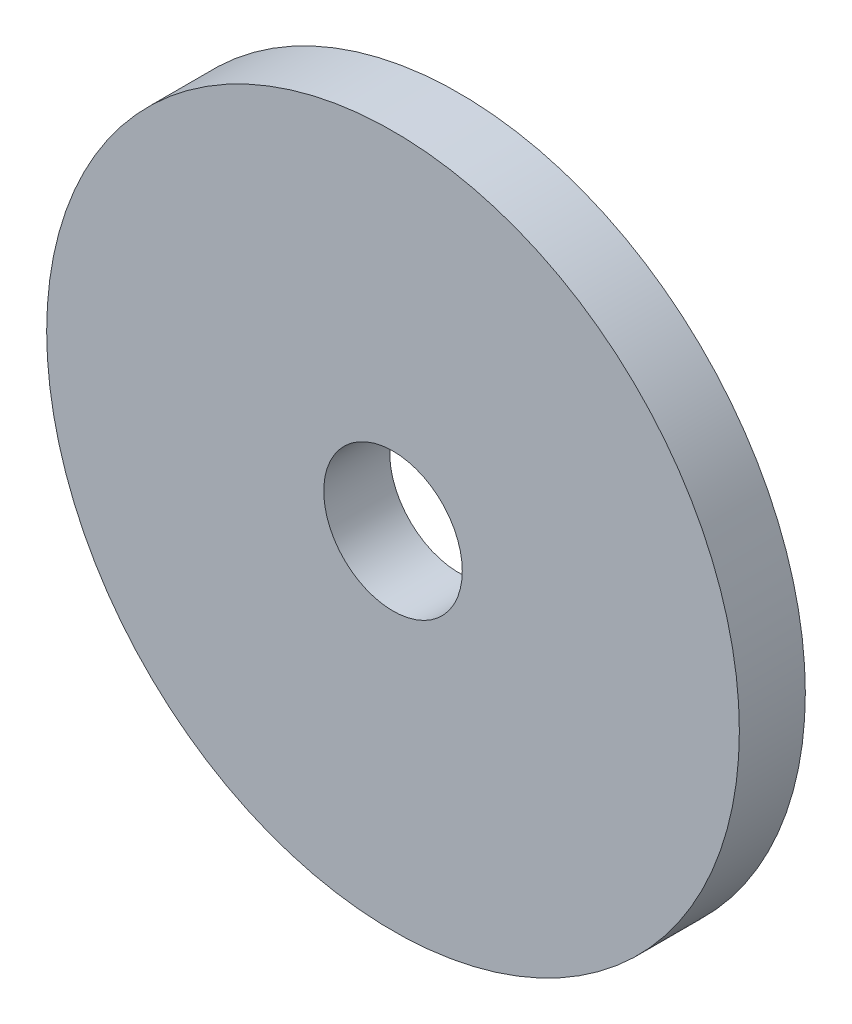
ISO-10303-21;
HEADER;
FILE_DESCRIPTION(('STEP AP214'),'2;1');
FILE_NAME('part.step','',(''),(''),'','','');
FILE_SCHEMA(('AUTOMOTIVE_DESIGN { 1 0 10303 214 1 1 1 1 }'));
ENDSEC;
DATA;
#1=APPLICATION_CONTEXT('core data for automotive mechanical design processes');
#2=APPLICATION_PROTOCOL_DEFINITION('international standard','automotive_design',2000,#1);
#3=PRODUCT_CONTEXT('',#1,'mechanical');
#4=PRODUCT('Part','Part','',(#3));
#5=PRODUCT_RELATED_PRODUCT_CATEGORY('part','',(#4));
#6=PRODUCT_DEFINITION_FORMATION('','',#4);
#7=PRODUCT_DEFINITION_CONTEXT('part definition',#1,'design');
#8=PRODUCT_DEFINITION('design','',#6,#7);
#9=PRODUCT_DEFINITION_SHAPE('','',#8);
#10=(LENGTH_UNIT() NAMED_UNIT(*) SI_UNIT(.MILLI.,.METRE.));
#11=(NAMED_UNIT(*) PLANE_ANGLE_UNIT() SI_UNIT($,.RADIAN.));
#12=(NAMED_UNIT(*) SI_UNIT($,.STERADIAN.) SOLID_ANGLE_UNIT());
#13=UNCERTAINTY_MEASURE_WITH_UNIT(LENGTH_MEASURE(1.E-05),#10,'distance_accuracy_value','');
#14=(GEOMETRIC_REPRESENTATION_CONTEXT(3) GLOBAL_UNCERTAINTY_ASSIGNED_CONTEXT((#13)) GLOBAL_UNIT_ASSIGNED_CONTEXT((#10,
#11,#12)) REPRESENTATION_CONTEXT('',''));
#15=CARTESIAN_POINT('',(0.,0.,0.));
#16=DIRECTION('',(0.,0.,1.));
#17=DIRECTION('',(1.,0.,0.));
#18=AXIS2_PLACEMENT_3D('',#15,#16,#17);
#19=CARTESIAN_POINT('',(0.,0.,2.));
#20=DIRECTION('',(0.,0.,1.));
#21=DIRECTION('',(1.,0.,0.));
#22=AXIS2_PLACEMENT_3D('',#19,#20,#21);
#23=PLANE('',#22);
#24=CARTESIAN_POINT('',(0.,0.,2.));
#25=DIRECTION('',(0.,0.,1.));
#26=DIRECTION('',(1.,0.,0.));
#27=AXIS2_PLACEMENT_3D('',#24,#25,#26);
#28=CIRCLE('',#27,10.5);
#29=CARTESIAN_POINT('',(10.5,0.,2.));
#30=VERTEX_POINT('',#29);
#31=EDGE_CURVE('E10',#30,#30,#28,.T.);
#32=ORIENTED_EDGE('',*,*,#31,.T.);
#33=EDGE_LOOP('',(#32));
#34=FACE_BOUND('',#33,.T.);
#35=CARTESIAN_POINT('',(0.,0.,2.));
#36=DIRECTION('',(0.,0.,1.));
#37=DIRECTION('',(1.,0.,0.));
#38=AXIS2_PLACEMENT_3D('',#35,#36,#37);
#39=CIRCLE('',#38,2.1);
#40=CARTESIAN_POINT('',(2.1,0.,2.));
#41=VERTEX_POINT('',#40);
#42=EDGE_CURVE('E42',#41,#41,#39,.T.);
#43=ORIENTED_EDGE('',*,*,#42,.F.);
#44=EDGE_LOOP('',(#43));
#45=FACE_BOUND('',#44,.T.);
#46=ADVANCED_FACE('F31',(#34,#45),#23,.T.);
#47=CARTESIAN_POINT('',(0.,0.,0.));
#48=DIRECTION('',(0.,0.,1.));
#49=DIRECTION('',(1.,0.,0.));
#50=AXIS2_PLACEMENT_3D('',#47,#48,#49);
#51=PLANE('',#50);
#52=CARTESIAN_POINT('',(0.,0.,0.));
#53=DIRECTION('',(0.,0.,1.));
#54=DIRECTION('',(1.,0.,0.));
#55=AXIS2_PLACEMENT_3D('',#52,#53,#54);
#56=CIRCLE('',#55,10.5);
#57=CARTESIAN_POINT('',(10.5,0.,0.));
#58=VERTEX_POINT('',#57);
#59=EDGE_CURVE('E35',#58,#58,#56,.T.);
#60=ORIENTED_EDGE('',*,*,#59,.F.);
#61=EDGE_LOOP('',(#60));
#62=FACE_BOUND('',#61,.T.);
#63=CARTESIAN_POINT('',(0.,0.,0.));
#64=DIRECTION('',(0.,0.,1.));
#65=DIRECTION('',(1.,0.,0.));
#66=AXIS2_PLACEMENT_3D('',#63,#64,#65);
#67=CIRCLE('',#66,2.1);
#68=CARTESIAN_POINT('',(2.1,0.,0.));
#69=VERTEX_POINT('',#68);
#70=EDGE_CURVE('E44',#69,#69,#67,.T.);
#71=ORIENTED_EDGE('',*,*,#70,.T.);
#72=EDGE_LOOP('',(#71));
#73=FACE_BOUND('',#72,.T.);
#74=ADVANCED_FACE('F54',(#62,#73),#51,.F.);
#75=CARTESIAN_POINT('',(0.,0.,2.));
#76=DIRECTION('',(0.,0.,-1.));
#77=DIRECTION('',(-1.,0.,0.));
#78=AXIS2_PLACEMENT_3D('',#75,#76,#77);
#79=CYLINDRICAL_SURFACE('',#78,10.5);
#80=ORIENTED_EDGE('',*,*,#31,.F.);
#81=EDGE_LOOP('',(#80));
#82=FACE_BOUND('',#81,.T.);
#83=ORIENTED_EDGE('',*,*,#59,.T.);
#84=EDGE_LOOP('',(#83));
#85=FACE_BOUND('',#84,.T.);
#86=ADVANCED_FACE('F33',(#82,#85),#79,.T.);
#87=CARTESIAN_POINT('',(0.,0.,2.));
#88=DIRECTION('',(0.,0.,-1.));
#89=DIRECTION('',(-1.,0.,0.));
#90=AXIS2_PLACEMENT_3D('',#87,#88,#89);
#91=CYLINDRICAL_SURFACE('',#90,2.1);
#92=ORIENTED_EDGE('',*,*,#42,.T.);
#93=EDGE_LOOP('',(#92));
#94=FACE_BOUND('',#93,.T.);
#95=ORIENTED_EDGE('',*,*,#70,.F.);
#96=EDGE_LOOP('',(#95));
#97=FACE_BOUND('',#96,.T.);
#98=ADVANCED_FACE('F50',(#94,#97),#91,.F.);
#99=CLOSED_SHELL('',(#46,#74,#86,#98));
#100=MANIFOLD_SOLID_BREP('B2',#99);
#101=ADVANCED_BREP_SHAPE_REPRESENTATION('',(#18,#100),#14);
#102=SHAPE_DEFINITION_REPRESENTATION(#9,#101);
ENDSEC;
END-ISO-10303-21;
